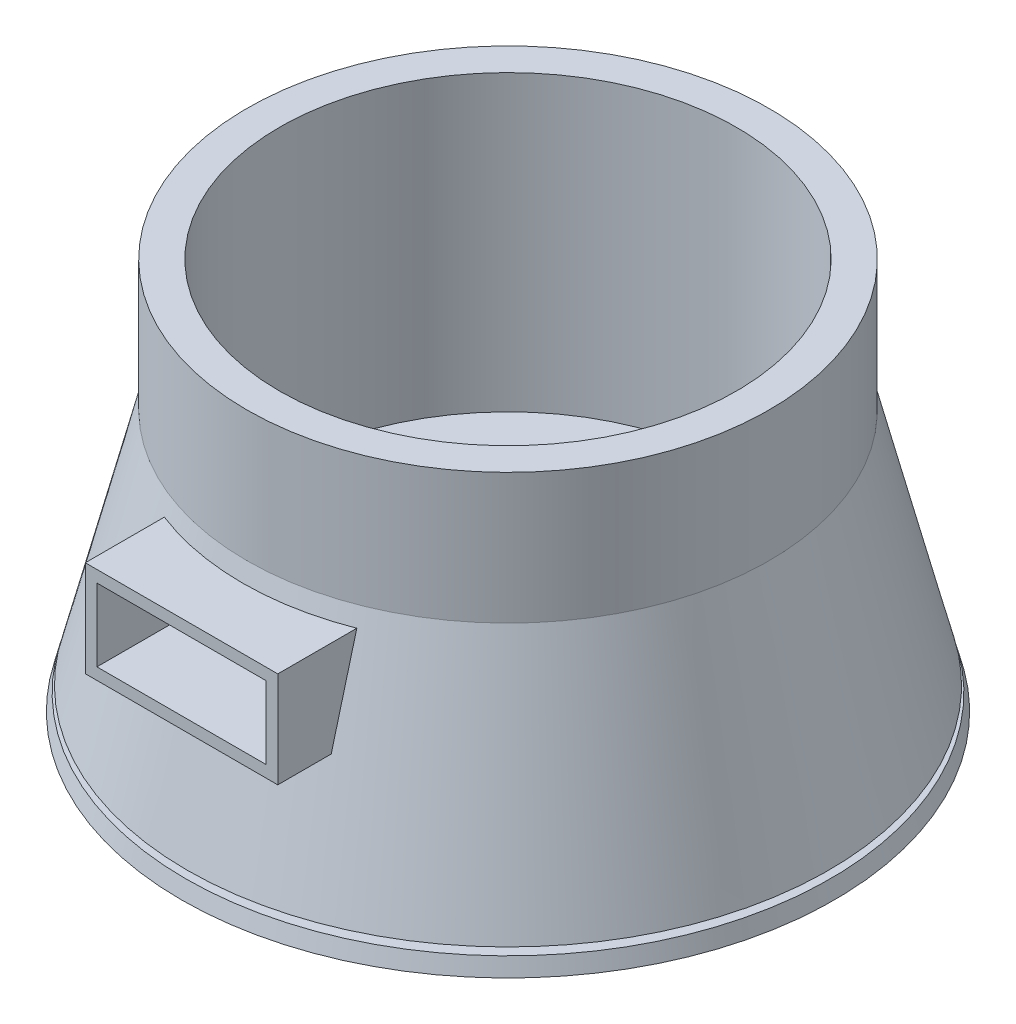
ISO-10303-21;
HEADER;
FILE_DESCRIPTION(('STEP AP214'),'2;1');
FILE_NAME('part.step','',(''),(''),'','','');
FILE_SCHEMA(('AUTOMOTIVE_DESIGN { 1 0 10303 214 1 1 1 1 }'));
ENDSEC;
DATA;
#1=APPLICATION_CONTEXT('core data for automotive mechanical design processes');
#2=APPLICATION_PROTOCOL_DEFINITION('international standard','automotive_design',2000,#1);
#3=PRODUCT_CONTEXT('',#1,'mechanical');
#4=PRODUCT('Part','Part','',(#3));
#5=PRODUCT_RELATED_PRODUCT_CATEGORY('part','',(#4));
#6=PRODUCT_DEFINITION_FORMATION('','',#4);
#7=PRODUCT_DEFINITION_CONTEXT('part definition',#1,'design');
#8=PRODUCT_DEFINITION('design','',#6,#7);
#9=PRODUCT_DEFINITION_SHAPE('','',#8);
#10=(LENGTH_UNIT() NAMED_UNIT(*) SI_UNIT(.MILLI.,.METRE.));
#11=(NAMED_UNIT(*) PLANE_ANGLE_UNIT() SI_UNIT($,.RADIAN.));
#12=(NAMED_UNIT(*) SI_UNIT($,.STERADIAN.) SOLID_ANGLE_UNIT());
#13=UNCERTAINTY_MEASURE_WITH_UNIT(LENGTH_MEASURE(1.E-05),#10,'distance_accuracy_value','');
#14=(GEOMETRIC_REPRESENTATION_CONTEXT(3) GLOBAL_UNCERTAINTY_ASSIGNED_CONTEXT((#13)) GLOBAL_UNIT_ASSIGNED_CONTEXT((#10,
#11,#12)) REPRESENTATION_CONTEXT('',''));
#15=CARTESIAN_POINT('',(0.,0.,0.));
#16=DIRECTION('',(0.,0.,1.));
#17=DIRECTION('',(1.,0.,0.));
#18=AXIS2_PLACEMENT_3D('',#15,#16,#17);
#19=CARTESIAN_POINT('',(0.,31.4615218794639,0.));
#20=DIRECTION('',(0.,1.,0.));
#21=DIRECTION('',(0.,0.,1.));
#22=AXIS2_PLACEMENT_3D('',#19,#20,#21);
#23=CYLINDRICAL_SURFACE('',#22,5.);
#24=CARTESIAN_POINT('',(0.,2.5,0.));
#25=DIRECTION('',(0.,1.,0.));
#26=DIRECTION('',(0.,0.,1.));
#27=AXIS2_PLACEMENT_3D('',#24,#25,#26);
#28=CIRCLE('',#27,5.);
#29=CARTESIAN_POINT('',(0.,2.5,5.));
#30=VERTEX_POINT('',#29);
#31=EDGE_CURVE('E253',#30,#30,#28,.T.);
#32=ORIENTED_EDGE('',*,*,#31,.F.);
#33=EDGE_LOOP('',(#32));
#34=FACE_BOUND('',#33,.T.);
#35=CARTESIAN_POINT('',(0.,7.5,0.));
#36=DIRECTION('',(0.,1.,0.));
#37=DIRECTION('',(0.,0.,1.));
#38=AXIS2_PLACEMENT_3D('',#35,#36,#37);
#39=CIRCLE('',#38,5.);
#40=CARTESIAN_POINT('',(0.,7.5,5.));
#41=VERTEX_POINT('',#40);
#42=EDGE_CURVE('E129',#41,#41,#39,.F.);
#43=ORIENTED_EDGE('',*,*,#42,.F.);
#44=EDGE_LOOP('',(#43));
#45=FACE_BOUND('',#44,.T.);
#46=ADVANCED_FACE('F40',(#34,#45),#23,.F.);
#47=CARTESIAN_POINT('',(0.,1.25,0.));
#48=DIRECTION('',(0.,-1.,0.));
#49=DIRECTION('',(0.,0.,-1.));
#50=AXIS2_PLACEMENT_3D('',#47,#48,#49);
#51=PLANE('',#50);
#52=CARTESIAN_POINT('',(0.,1.25,0.));
#53=DIRECTION('',(0.,1.,0.));
#54=DIRECTION('',(0.,0.,1.));
#55=AXIS2_PLACEMENT_3D('',#52,#53,#54);
#56=CIRCLE('',#55,23.75);
#57=CARTESIAN_POINT('',(0.,1.25,23.75));
#58=VERTEX_POINT('',#57);
#59=EDGE_CURVE('E274',#58,#58,#56,.T.);
#60=ORIENTED_EDGE('',*,*,#59,.F.);
#61=EDGE_LOOP('',(#60));
#62=FACE_BOUND('',#61,.T.);
#63=CARTESIAN_POINT('',(0.,1.25,0.));
#64=DIRECTION('',(0.,1.,0.));
#65=DIRECTION('',(0.,0.,1.));
#66=AXIS2_PLACEMENT_3D('',#63,#64,#65);
#67=CIRCLE('',#66,24.6875);
#68=CARTESIAN_POINT('',(0.,1.25,24.6875));
#69=VERTEX_POINT('',#68);
#70=EDGE_CURVE('E217',#69,#69,#67,.T.);
#71=ORIENTED_EDGE('',*,*,#70,.T.);
#72=EDGE_LOOP('',(#71));
#73=FACE_BOUND('',#72,.T.);
#74=ADVANCED_FACE('F161',(#62,#73),#51,.F.);
#75=CARTESIAN_POINT('',(0.,1.25,0.));
#76=DIRECTION('',(0.,-1.,0.));
#77=DIRECTION('',(0.,0.,-1.));
#78=AXIS2_PLACEMENT_3D('',#75,#76,#77);
#79=CONICAL_SURFACE('',#78,24.6875,0.244978663126864);
#80=CARTESIAN_POINT('',(0.,0.,0.));
#81=DIRECTION('',(0.,1.,0.));
#82=DIRECTION('',(0.,0.,1.));
#83=AXIS2_PLACEMENT_3D('',#80,#81,#82);
#84=CIRCLE('',#83,25.);
#85=CARTESIAN_POINT('',(0.,0.,25.));
#86=VERTEX_POINT('',#85);
#87=EDGE_CURVE('E212',#86,#86,#84,.T.);
#88=ORIENTED_EDGE('',*,*,#87,.T.);
#89=EDGE_LOOP('',(#88));
#90=FACE_BOUND('',#89,.T.);
#91=ORIENTED_EDGE('',*,*,#70,.F.);
#92=EDGE_LOOP('',(#91));
#93=FACE_BOUND('',#92,.T.);
#94=ADVANCED_FACE('F163',(#90,#93),#79,.T.);
#95=CARTESIAN_POINT('',(0.,31.4615218794639,0.));
#96=DIRECTION('',(0.,1.,0.));
#97=DIRECTION('',(0.,0.,1.));
#98=AXIS2_PLACEMENT_3D('',#95,#96,#97);
#99=CYLINDRICAL_SURFACE('',#98,23.75);
#100=ORIENTED_EDGE('',*,*,#59,.T.);
#101=EDGE_LOOP('',(#100));
#102=FACE_BOUND('',#101,.T.);
#103=CARTESIAN_POINT('',(0.,1.75,0.));
#104=DIRECTION('',(0.,1.,0.));
#105=DIRECTION('',(0.,0.,1.));
#106=AXIS2_PLACEMENT_3D('',#103,#104,#105);
#107=CIRCLE('',#106,23.75);
#108=CARTESIAN_POINT('',(0.,1.75,23.75));
#109=VERTEX_POINT('',#108);
#110=EDGE_CURVE('E222',#109,#109,#107,.T.);
#111=ORIENTED_EDGE('',*,*,#110,.F.);
#112=EDGE_LOOP('',(#111));
#113=FACE_BOUND('',#112,.T.);
#114=ADVANCED_FACE('F190',(#102,#113),#99,.T.);
#115=CARTESIAN_POINT('',(0.,31.4615218794639,0.));
#116=DIRECTION('',(0.,1.,0.));
#117=DIRECTION('',(0.,0.,1.));
#118=AXIS2_PLACEMENT_3D('',#115,#116,#117);
#119=CYLINDRICAL_SURFACE('',#118,20.);
#120=CARTESIAN_POINT('',(0.,20.,0.));
#121=DIRECTION('',(0.,1.,0.));
#122=DIRECTION('',(0.,0.,1.));
#123=AXIS2_PLACEMENT_3D('',#120,#121,#122);
#124=CIRCLE('',#123,20.);
#125=CARTESIAN_POINT('',(0.,20.,20.));
#126=VERTEX_POINT('',#125);
#127=EDGE_CURVE('E207',#126,#126,#124,.T.);
#128=ORIENTED_EDGE('',*,*,#127,.T.);
#129=EDGE_LOOP('',(#128));
#130=FACE_BOUND('',#129,.T.);
#131=CARTESIAN_POINT('',(0.,30.,0.));
#132=DIRECTION('',(0.,1.,0.));
#133=DIRECTION('',(0.,0.,1.));
#134=AXIS2_PLACEMENT_3D('',#131,#132,#133);
#135=CIRCLE('',#134,20.);
#136=CARTESIAN_POINT('',(0.,30.,20.));
#137=VERTEX_POINT('',#136);
#138=EDGE_CURVE('E210',#137,#137,#135,.T.);
#139=ORIENTED_EDGE('',*,*,#138,.F.);
#140=EDGE_LOOP('',(#139));
#141=FACE_BOUND('',#140,.T.);
#142=ADVANCED_FACE('F193',(#130,#141),#119,.T.);
#143=CARTESIAN_POINT('',(0.,20.,0.));
#144=DIRECTION('',(0.,-1.,0.));
#145=DIRECTION('',(0.,0.,-1.));
#146=AXIS2_PLACEMENT_3D('',#143,#144,#145);
#147=CONICAL_SURFACE('',#146,20.,0.244978663126864);
#148=CARTESIAN_POINT('',(7.37000000000001,-14.3216899381842,27.6138307627744));
#149=CARTESIAN_POINT('',(7.37000000000001,-12.4658660344797,27.133621653967));
#150=CARTESIAN_POINT('',(7.37000000000001,-10.6102378051404,26.6526549550244));
#151=CARTESIAN_POINT('',(7.37000000000001,-6.89945704703358,25.6888831354113));
#152=CARTESIAN_POINT('',(7.37000000000001,-5.04430451870854,25.2060780130375));
#153=CARTESIAN_POINT('',(7.37000000000001,-1.33451409837843,24.2382942487228));
#154=CARTESIAN_POINT('',(7.37,0.520123778784556,23.7533155498681));
#155=CARTESIAN_POINT('',(7.37,4.22871941399425,22.780766472461));
#156=CARTESIAN_POINT('',(7.37,6.08267717228313,22.2931960948324));
#157=CARTESIAN_POINT('',(7.37,9.78952780102709,21.3149763770174));
#158=CARTESIAN_POINT('',(7.37,11.6424207771001,20.8243274372334));
#159=CARTESIAN_POINT('',(7.37,15.3471795180583,19.8391672524519));
#160=CARTESIAN_POINT('',(7.37,17.1990452833739,19.3446560090739));
#161=CARTESIAN_POINT('',(7.37,20.9014636237397,18.350804274735));
#162=CARTESIAN_POINT('',(7.37,22.7520162103477,17.8514638268587));
#163=CARTESIAN_POINT('',(7.37,26.4514465925507,16.8466215226613));
#164=CARTESIAN_POINT('',(7.37,28.3003243914189,16.34111967841));
#165=CARTESIAN_POINT('',(7.37,31.3316931131378,15.5051771662246));
#166=CARTESIAN_POINT('',(7.37,32.5148415559899,15.1771215767288));
#167=CARTESIAN_POINT('',(7.37,34.8800134671355,14.5169886077337));
#168=CARTESIAN_POINT('',(7.37,36.0620369383523,14.184911238716));
#169=CARTESIAN_POINT('',(7.37,38.4247369168027,13.5158201791193));
#170=CARTESIAN_POINT('',(7.37,39.6054133710248,13.1788063010293));
#171=CARTESIAN_POINT('',(7.37,41.3751033208345,12.6686682671595));
#172=CARTESIAN_POINT('',(7.36999999999999,41.9647821776197,12.4978518393217));
#173=CARTESIAN_POINT('',(7.36999999999999,43.1436328361598,12.1544739899294));
#174=CARTESIAN_POINT('',(7.36999999999999,43.7328046368487,11.9819125647162));
#175=CARTESIAN_POINT('',(7.36999999999999,44.3216899381842,11.8083757650547));
#176=B_SPLINE_CURVE_WITH_KNOTS('',3,(#148,#149,#150,#151,#152,#153,#154,#155,#156,#157,#158,
#159,#160,#161,#162,#163,#164,#165,#166,#167,#168,#169,#170,#171,#172,#173,#174,#175),
.UNSPECIFIED.,.F.,.F.,(4,2,2,2,2,2,2,2,2,2,2,2,2,4),(0.,5.75083928311323,11.5016838949989,
17.2526799790413,23.0036740133579,28.7539349599857,34.5041934955168,40.254400776337,
46.0045967948004,49.6879518684337,53.3712973444617,57.0547830952882,58.8965447033079,
60.7383101738493),.UNSPECIFIED.);
#177=CARTESIAN_POINT('',(7.37,11.32,20.909136758843));
#178=VERTEX_POINT('',#177);
#179=CARTESIAN_POINT('',(7.37,18.68,18.9470842083947));
#180=VERTEX_POINT('',#179);
#181=EDGE_CURVE('E122',#178,#180,#176,.T.);
#182=ORIENTED_EDGE('',*,*,#181,.F.);
#183=CARTESIAN_POINT('',(0.,11.32,0.));
#184=DIRECTION('',(0.,1.,0.));
#185=DIRECTION('',(-1.,0.,0.));
#186=AXIS2_PLACEMENT_3D('',#183,#184,#185);
#187=CIRCLE('',#186,22.17);
#188=CARTESIAN_POINT('',(-7.37,11.32,20.909136758843));
#189=VERTEX_POINT('',#188);
#190=EDGE_CURVE('E232',#178,#189,#187,.F.);
#191=ORIENTED_EDGE('',*,*,#190,.T.);
#192=CARTESIAN_POINT('',(-7.36999999999999,-14.3216899381842,27.6138307627744));
#193=CARTESIAN_POINT('',(-7.36999999999999,-12.4658660344798,27.133621653967));
#194=CARTESIAN_POINT('',(-7.36999999999999,-10.6102378051404,26.6526549550244));
#195=CARTESIAN_POINT('',(-7.36999999999999,-6.89945704703359,25.6888831354113));
#196=CARTESIAN_POINT('',(-7.36999999999999,-5.04430451870854,25.2060780130375));
#197=CARTESIAN_POINT('',(-7.36999999999999,-1.33451409837844,24.2382942487228));
#198=CARTESIAN_POINT('',(-7.37,0.520123778784551,23.7533155498681));
#199=CARTESIAN_POINT('',(-7.37,4.22871941399425,22.780766472461));
#200=CARTESIAN_POINT('',(-7.37,6.08267717228312,22.2931960948324));
#201=CARTESIAN_POINT('',(-7.37,9.78952780102709,21.3149763770174));
#202=CARTESIAN_POINT('',(-7.37,11.6424207771001,20.8243274372334));
#203=CARTESIAN_POINT('',(-7.37,15.3471795180583,19.8391672524519));
#204=CARTESIAN_POINT('',(-7.37,17.1990452833739,19.3446560090739));
#205=CARTESIAN_POINT('',(-7.37,20.9014636237397,18.350804274735));
#206=CARTESIAN_POINT('',(-7.37,22.7520162103477,17.8514638268587));
#207=CARTESIAN_POINT('',(-7.37,26.4514465925507,16.8466215226613));
#208=CARTESIAN_POINT('',(-7.37,28.3003243914189,16.34111967841));
#209=CARTESIAN_POINT('',(-7.37,31.3316931131378,15.5051771662246));
#210=CARTESIAN_POINT('',(-7.37,32.5148415559899,15.1771215767288));
#211=CARTESIAN_POINT('',(-7.37,34.8800134671355,14.5169886077337));
#212=CARTESIAN_POINT('',(-7.37,36.0620369383523,14.184911238716));
#213=CARTESIAN_POINT('',(-7.37,38.4247369168027,13.5158201791192));
#214=CARTESIAN_POINT('',(-7.37,39.6054133710248,13.1788063010293));
#215=CARTESIAN_POINT('',(-7.37,41.3751033208345,12.6686682671595));
#216=CARTESIAN_POINT('',(-7.37000000000001,41.9647821776197,12.4978518393217));
#217=CARTESIAN_POINT('',(-7.37000000000001,43.1436328361598,12.1544739899294));
#218=CARTESIAN_POINT('',(-7.37000000000001,43.7328046368487,11.9819125647162));
#219=CARTESIAN_POINT('',(-7.37000000000001,44.3216899381842,11.8083757650547));
#220=B_SPLINE_CURVE_WITH_KNOTS('',3,(#192,#193,#194,#195,#196,#197,#198,#199,#200,#201,#202,
#203,#204,#205,#206,#207,#208,#209,#210,#211,#212,#213,#214,#215,#216,#217,#218,#219),
.UNSPECIFIED.,.F.,.F.,(4,2,2,2,2,2,2,2,2,2,2,2,2,4),(0.,5.75083928311323,11.5016838949989,
17.2526799790413,23.0036740133579,28.7539349599858,34.5041934955168,40.254400776337,
46.0045967948004,49.6879518684337,53.3712973444617,57.0547830952882,58.8965447033079,
60.7383101738493),.UNSPECIFIED.);
#221=CARTESIAN_POINT('',(-7.37,18.68,18.9470842083947));
#222=VERTEX_POINT('',#221);
#223=EDGE_CURVE('E141',#189,#222,#220,.T.);
#224=ORIENTED_EDGE('',*,*,#223,.T.);
#225=CARTESIAN_POINT('',(0.,18.68,0.));
#226=DIRECTION('',(0.,1.,0.));
#227=DIRECTION('',(0.,0.,1.));
#228=AXIS2_PLACEMENT_3D('',#225,#226,#227);
#229=CIRCLE('',#228,20.33);
#230=EDGE_CURVE('E231',#180,#222,#229,.F.);
#231=ORIENTED_EDGE('',*,*,#230,.F.);
#232=EDGE_LOOP('',(#182,#191,#224,#231));
#233=FACE_BOUND('',#232,.T.);
#234=CARTESIAN_POINT('',(0.,1.75,0.));
#235=DIRECTION('',(0.,1.,0.));
#236=DIRECTION('',(0.,0.,1.));
#237=AXIS2_PLACEMENT_3D('',#234,#235,#236);
#238=CIRCLE('',#237,24.5625);
#239=CARTESIAN_POINT('',(0.,1.75,24.5625));
#240=VERTEX_POINT('',#239);
#241=EDGE_CURVE('E214',#240,#240,#238,.T.);
#242=ORIENTED_EDGE('',*,*,#241,.T.);
#243=EDGE_LOOP('',(#242));
#244=FACE_BOUND('',#243,.T.);
#245=ORIENTED_EDGE('',*,*,#127,.F.);
#246=EDGE_LOOP('',(#245));
#247=FACE_BOUND('',#246,.T.);
#248=ADVANCED_FACE('F148',(#233,#244,#247),#147,.T.);
#249=CARTESIAN_POINT('',(0.,1.75,0.));
#250=DIRECTION('',(0.,-1.,0.));
#251=DIRECTION('',(0.,0.,-1.));
#252=AXIS2_PLACEMENT_3D('',#249,#250,#251);
#253=PLANE('',#252);
#254=ORIENTED_EDGE('',*,*,#110,.T.);
#255=EDGE_LOOP('',(#254));
#256=FACE_BOUND('',#255,.T.);
#257=ORIENTED_EDGE('',*,*,#241,.F.);
#258=EDGE_LOOP('',(#257));
#259=FACE_BOUND('',#258,.T.);
#260=ADVANCED_FACE('F200',(#256,#259),#253,.T.);
#261=CARTESIAN_POINT('',(0.,0.,0.));
#262=DIRECTION('',(0.,1.,0.));
#263=DIRECTION('',(0.,0.,1.));
#264=AXIS2_PLACEMENT_3D('',#261,#262,#263);
#265=PLANE('',#264);
#266=CARTESIAN_POINT('',(0.,0.,0.));
#267=DIRECTION('',(0.,1.,0.));
#268=DIRECTION('',(0.,0.,1.));
#269=AXIS2_PLACEMENT_3D('',#266,#267,#268);
#270=CIRCLE('',#269,24.);
#271=CARTESIAN_POINT('',(0.,0.,24.));
#272=VERTEX_POINT('',#271);
#273=EDGE_CURVE('E268',#272,#272,#270,.T.);
#274=ORIENTED_EDGE('',*,*,#273,.T.);
#275=EDGE_LOOP('',(#274));
#276=FACE_BOUND('',#275,.T.);
#277=ORIENTED_EDGE('',*,*,#87,.F.);
#278=EDGE_LOOP('',(#277));
#279=FACE_BOUND('',#278,.T.);
#280=ADVANCED_FACE('F177',(#276,#279),#265,.F.);
#281=CARTESIAN_POINT('',(0.,31.4615218794639,0.));
#282=DIRECTION('',(0.,1.,0.));
#283=DIRECTION('',(0.,0.,1.));
#284=AXIS2_PLACEMENT_3D('',#281,#282,#283);
#285=CYLINDRICAL_SURFACE('',#284,23.5);
#286=CARTESIAN_POINT('',(0.,0.,0.));
#287=DIRECTION('',(0.,1.,0.));
#288=DIRECTION('',(0.,0.,1.));
#289=AXIS2_PLACEMENT_3D('',#286,#287,#288);
#290=CIRCLE('',#289,23.5);
#291=CARTESIAN_POINT('',(0.,0.,23.5));
#292=VERTEX_POINT('',#291);
#293=EDGE_CURVE('E271',#292,#292,#290,.T.);
#294=ORIENTED_EDGE('',*,*,#293,.T.);
#295=EDGE_LOOP('',(#294));
#296=FACE_BOUND('',#295,.T.);
#297=CARTESIAN_POINT('',(0.,0.750000000000001,0.));
#298=DIRECTION('',(0.,1.,0.));
#299=DIRECTION('',(0.,0.,1.));
#300=AXIS2_PLACEMENT_3D('',#297,#298,#299);
#301=CIRCLE('',#300,23.5);
#302=CARTESIAN_POINT('',(0.,0.750000000000001,23.5));
#303=VERTEX_POINT('',#302);
#304=EDGE_CURVE('E262',#303,#303,#301,.T.);
#305=ORIENTED_EDGE('',*,*,#304,.F.);
#306=EDGE_LOOP('',(#305));
#307=FACE_BOUND('',#306,.T.);
#308=ADVANCED_FACE('F173',(#296,#307),#285,.T.);
#309=CARTESIAN_POINT('',(0.,0.749999999999999,0.));
#310=DIRECTION('',(0.,-1.,0.));
#311=DIRECTION('',(0.,0.,-1.));
#312=AXIS2_PLACEMENT_3D('',#309,#310,#311);
#313=PLANE('',#312);
#314=ORIENTED_EDGE('',*,*,#304,.T.);
#315=EDGE_LOOP('',(#314));
#316=FACE_BOUND('',#315,.T.);
#317=CARTESIAN_POINT('',(0.,0.750000000000001,0.));
#318=DIRECTION('',(0.,1.,0.));
#319=DIRECTION('',(0.,0.,1.));
#320=AXIS2_PLACEMENT_3D('',#317,#318,#319);
#321=CIRCLE('',#320,24.);
#322=CARTESIAN_POINT('',(0.,0.750000000000001,24.));
#323=VERTEX_POINT('',#322);
#324=EDGE_CURVE('E265',#323,#323,#321,.T.);
#325=ORIENTED_EDGE('',*,*,#324,.F.);
#326=EDGE_LOOP('',(#325));
#327=FACE_BOUND('',#326,.T.);
#328=ADVANCED_FACE('F176',(#316,#327),#313,.T.);
#329=CARTESIAN_POINT('',(0.,31.4615218794639,0.));
#330=DIRECTION('',(0.,1.,0.));
#331=DIRECTION('',(0.,0.,1.));
#332=AXIS2_PLACEMENT_3D('',#329,#330,#331);
#333=CYLINDRICAL_SURFACE('',#332,24.);
#334=ORIENTED_EDGE('',*,*,#273,.F.);
#335=EDGE_LOOP('',(#334));
#336=FACE_BOUND('',#335,.T.);
#337=ORIENTED_EDGE('',*,*,#324,.T.);
#338=EDGE_LOOP('',(#337));
#339=FACE_BOUND('',#338,.T.);
#340=ADVANCED_FACE('F181',(#336,#339),#333,.F.);
#341=CARTESIAN_POINT('',(0.,30.,0.));
#342=DIRECTION('',(0.,1.,0.));
#343=DIRECTION('',(0.,0.,1.));
#344=AXIS2_PLACEMENT_3D('',#341,#342,#343);
#345=PLANE('',#344);
#346=CARTESIAN_POINT('',(0.,30.,0.));
#347=DIRECTION('',(0.,1.,0.));
#348=DIRECTION('',(0.,0.,1.));
#349=AXIS2_PLACEMENT_3D('',#346,#347,#348);
#350=CIRCLE('',#349,17.5);
#351=CARTESIAN_POINT('',(0.,30.,17.5));
#352=VERTEX_POINT('',#351);
#353=EDGE_CURVE('E542',#352,#352,#350,.T.);
#354=ORIENTED_EDGE('',*,*,#353,.F.);
#355=EDGE_LOOP('',(#354));
#356=FACE_BOUND('',#355,.T.);
#357=ORIENTED_EDGE('',*,*,#138,.T.);
#358=EDGE_LOOP('',(#357));
#359=FACE_BOUND('',#358,.T.);
#360=ADVANCED_FACE('F185',(#356,#359),#345,.T.);
#361=CARTESIAN_POINT('',(0.,0.,0.));
#362=DIRECTION('',(0.,1.,0.));
#363=DIRECTION('',(0.,0.,1.));
#364=AXIS2_PLACEMENT_3D('',#361,#362,#363);
#365=CIRCLE('',#364,22.5);
#366=CARTESIAN_POINT('',(0.,0.,22.5));
#367=VERTEX_POINT('',#366);
#368=EDGE_CURVE('E259',#367,#367,#365,.T.);
#369=ORIENTED_EDGE('',*,*,#368,.T.);
#370=EDGE_LOOP('',(#369));
#371=FACE_BOUND('',#370,.T.);
#372=ORIENTED_EDGE('',*,*,#293,.F.);
#373=EDGE_LOOP('',(#372));
#374=FACE_BOUND('',#373,.T.);
#375=ADVANCED_FACE('F42',(#371,#374),#265,.F.);
#376=CARTESIAN_POINT('',(0.,0.,0.));
#377=DIRECTION('',(0.,-1.,0.));
#378=DIRECTION('',(0.,0.,-1.));
#379=AXIS2_PLACEMENT_3D('',#376,#377,#378);
#380=CONICAL_SURFACE('',#379,22.5,1.24904577239825);
#381=CARTESIAN_POINT('',(0.,2.5,0.));
#382=DIRECTION('',(0.,1.,0.));
#383=DIRECTION('',(0.,0.,1.));
#384=AXIS2_PLACEMENT_3D('',#381,#382,#383);
#385=CIRCLE('',#384,15.);
#386=CARTESIAN_POINT('',(0.,2.5,15.));
#387=VERTEX_POINT('',#386);
#388=EDGE_CURVE('E256',#387,#387,#385,.T.);
#389=ORIENTED_EDGE('',*,*,#388,.T.);
#390=EDGE_LOOP('',(#389));
#391=FACE_BOUND('',#390,.T.);
#392=ORIENTED_EDGE('',*,*,#368,.F.);
#393=EDGE_LOOP('',(#392));
#394=FACE_BOUND('',#393,.T.);
#395=ADVANCED_FACE('F168',(#391,#394),#380,.F.);
#396=CARTESIAN_POINT('',(0.,2.5,0.));
#397=DIRECTION('',(0.,-1.,0.));
#398=DIRECTION('',(0.,0.,-1.));
#399=AXIS2_PLACEMENT_3D('',#396,#397,#398);
#400=PLANE('',#399);
#401=ORIENTED_EDGE('',*,*,#31,.T.);
#402=EDGE_LOOP('',(#401));
#403=FACE_BOUND('',#402,.T.);
#404=ORIENTED_EDGE('',*,*,#388,.F.);
#405=EDGE_LOOP('',(#404));
#406=FACE_BOUND('',#405,.T.);
#407=ADVANCED_FACE('F164',(#403,#406),#400,.T.);
#408=CARTESIAN_POINT('',(0.,17.78,25.));
#409=DIRECTION('',(0.,1.,0.));
#410=DIRECTION('',(0.,0.,1.));
#411=AXIS2_PLACEMENT_3D('',#408,#409,#410);
#412=PLANE('',#411);
#413=DIRECTION('',(0.,0.,-1.));
#414=VECTOR('',#413,1.);
#415=CARTESIAN_POINT('',(-6.48,17.78,25.));
#416=LINE('',#415,#414);
#417=CARTESIAN_POINT('',(-6.48,17.78,25.));
#418=VERTEX_POINT('',#417);
#419=CARTESIAN_POINT('',(-6.48,17.78,16.256063484128));
#420=VERTEX_POINT('',#419);
#421=EDGE_CURVE('E116',#418,#420,#416,.T.);
#422=ORIENTED_EDGE('',*,*,#421,.T.);
#423=CARTESIAN_POINT('',(0.,17.78,0.));
#424=DIRECTION('',(0.,1.,0.));
#425=DIRECTION('',(0.,0.,1.));
#426=AXIS2_PLACEMENT_3D('',#423,#424,#425);
#427=CIRCLE('',#426,17.5);
#428=CARTESIAN_POINT('',(6.48,17.78,16.256063484128));
#429=VERTEX_POINT('',#428);
#430=EDGE_CURVE('E48',#429,#420,#427,.F.);
#431=ORIENTED_EDGE('',*,*,#430,.F.);
#432=DIRECTION('',(0.,0.,-1.));
#433=VECTOR('',#432,1.);
#434=CARTESIAN_POINT('',(6.48,17.78,25.));
#435=LINE('',#434,#433);
#436=CARTESIAN_POINT('',(6.48,17.78,25.));
#437=VERTEX_POINT('',#436);
#438=EDGE_CURVE('E251',#437,#429,#435,.T.);
#439=ORIENTED_EDGE('',*,*,#438,.F.);
#440=DIRECTION('',(1.,0.,0.));
#441=VECTOR('',#440,1.);
#442=CARTESIAN_POINT('',(0.,17.78,25.));
#443=LINE('',#442,#441);
#444=EDGE_CURVE('E524',#418,#437,#443,.T.);
#445=ORIENTED_EDGE('',*,*,#444,.F.);
#446=EDGE_LOOP('',(#422,#431,#439,#445));
#447=FACE_BOUND('',#446,.T.);
#448=ADVANCED_FACE('F167',(#447),#412,.F.);
#449=CARTESIAN_POINT('',(6.48,0.,25.));
#450=DIRECTION('',(1.,0.,0.));
#451=DIRECTION('',(0.,0.,-1.));
#452=AXIS2_PLACEMENT_3D('',#449,#450,#451);
#453=PLANE('',#452);
#454=ORIENTED_EDGE('',*,*,#438,.T.);
#455=DIRECTION('',(0.,1.,0.));
#456=VECTOR('',#455,1.);
#457=CARTESIAN_POINT('',(6.48,7.5,16.256063484128));
#458=LINE('',#457,#456);
#459=CARTESIAN_POINT('',(6.48,12.22,16.256063484128));
#460=VERTEX_POINT('',#459);
#461=EDGE_CURVE('E11',#460,#429,#458,.T.);
#462=ORIENTED_EDGE('',*,*,#461,.F.);
#463=DIRECTION('',(0.,0.,-1.));
#464=VECTOR('',#463,1.);
#465=CARTESIAN_POINT('',(6.48,12.22,25.));
#466=LINE('',#465,#464);
#467=CARTESIAN_POINT('',(6.48,12.22,25.));
#468=VERTEX_POINT('',#467);
#469=EDGE_CURVE('E55',#468,#460,#466,.T.);
#470=ORIENTED_EDGE('',*,*,#469,.F.);
#471=DIRECTION('',(0.,-1.,0.));
#472=VECTOR('',#471,1.);
#473=CARTESIAN_POINT('',(6.48,0.,25.));
#474=LINE('',#473,#472);
#475=EDGE_CURVE('E520',#437,#468,#474,.T.);
#476=ORIENTED_EDGE('',*,*,#475,.F.);
#477=EDGE_LOOP('',(#454,#462,#470,#476));
#478=FACE_BOUND('',#477,.T.);
#479=ADVANCED_FACE('F465',(#478),#453,.F.);
#480=CARTESIAN_POINT('',(0.,12.22,25.));
#481=DIRECTION('',(0.,1.,0.));
#482=DIRECTION('',(0.,0.,1.));
#483=AXIS2_PLACEMENT_3D('',#480,#481,#482);
#484=PLANE('',#483);
#485=ORIENTED_EDGE('',*,*,#469,.T.);
#486=CARTESIAN_POINT('',(0.,12.22,0.));
#487=DIRECTION('',(0.,1.,0.));
#488=DIRECTION('',(0.,0.,1.));
#489=AXIS2_PLACEMENT_3D('',#486,#487,#488);
#490=CIRCLE('',#489,17.5);
#491=CARTESIAN_POINT('',(-6.48,12.22,16.256063484128));
#492=VERTEX_POINT('',#491);
#493=EDGE_CURVE('E119',#460,#492,#490,.F.);
#494=ORIENTED_EDGE('',*,*,#493,.T.);
#495=DIRECTION('',(0.,0.,-1.));
#496=VECTOR('',#495,1.);
#497=CARTESIAN_POINT('',(-6.48,12.22,25.));
#498=LINE('',#497,#496);
#499=CARTESIAN_POINT('',(-6.48,12.22,25.));
#500=VERTEX_POINT('',#499);
#501=EDGE_CURVE('E108',#500,#492,#498,.T.);
#502=ORIENTED_EDGE('',*,*,#501,.F.);
#503=DIRECTION('',(1.,0.,0.));
#504=VECTOR('',#503,1.);
#505=CARTESIAN_POINT('',(0.,12.22,25.));
#506=LINE('',#505,#504);
#507=EDGE_CURVE('E532',#500,#468,#506,.T.);
#508=ORIENTED_EDGE('',*,*,#507,.T.);
#509=EDGE_LOOP('',(#485,#494,#502,#508));
#510=FACE_BOUND('',#509,.T.);
#511=ADVANCED_FACE('F120',(#510),#484,.T.);
#512=CARTESIAN_POINT('',(7.37000000000001,0.,25.));
#513=DIRECTION('',(1.,0.,0.));
#514=DIRECTION('',(0.,1.,0.));
#515=AXIS2_PLACEMENT_3D('',#512,#513,#514);
#516=PLANE('',#515);
#517=DIRECTION('',(0.,0.,-1.));
#518=VECTOR('',#517,1.);
#519=CARTESIAN_POINT('',(7.37,11.32,25.));
#520=LINE('',#519,#518);
#521=CARTESIAN_POINT('',(7.37,11.32,25.));
#522=VERTEX_POINT('',#521);
#523=EDGE_CURVE('E246',#522,#178,#520,.T.);
#524=ORIENTED_EDGE('',*,*,#523,.T.);
#525=ORIENTED_EDGE('',*,*,#181,.T.);
#526=DIRECTION('',(0.,0.,-1.));
#527=VECTOR('',#526,1.);
#528=CARTESIAN_POINT('',(7.37,18.68,25.));
#529=LINE('',#528,#527);
#530=CARTESIAN_POINT('',(7.37,18.68,25.));
#531=VERTEX_POINT('',#530);
#532=EDGE_CURVE('E242',#531,#180,#529,.T.);
#533=ORIENTED_EDGE('',*,*,#532,.F.);
#534=DIRECTION('',(0.,-1.,0.));
#535=VECTOR('',#534,1.);
#536=CARTESIAN_POINT('',(7.37000000000001,0.,25.));
#537=LINE('',#536,#535);
#538=EDGE_CURVE('E132',#531,#522,#537,.T.);
#539=ORIENTED_EDGE('',*,*,#538,.T.);
#540=EDGE_LOOP('',(#524,#525,#533,#539));
#541=FACE_BOUND('',#540,.T.);
#542=ADVANCED_FACE('F152',(#541),#516,.T.);
#543=CARTESIAN_POINT('',(0.,18.68,25.));
#544=DIRECTION('',(0.,1.,0.));
#545=DIRECTION('',(0.,0.,1.));
#546=AXIS2_PLACEMENT_3D('',#543,#544,#545);
#547=PLANE('',#546);
#548=ORIENTED_EDGE('',*,*,#532,.T.);
#549=ORIENTED_EDGE('',*,*,#230,.T.);
#550=DIRECTION('',(0.,0.,-1.));
#551=VECTOR('',#550,1.);
#552=CARTESIAN_POINT('',(-7.37,18.68,25.));
#553=LINE('',#552,#551);
#554=CARTESIAN_POINT('',(-7.37,18.68,25.));
#555=VERTEX_POINT('',#554);
#556=EDGE_CURVE('E237',#555,#222,#553,.T.);
#557=ORIENTED_EDGE('',*,*,#556,.F.);
#558=DIRECTION('',(1.,0.,0.));
#559=VECTOR('',#558,1.);
#560=CARTESIAN_POINT('',(0.,18.68,25.));
#561=LINE('',#560,#559);
#562=EDGE_CURVE('E539',#555,#531,#561,.T.);
#563=ORIENTED_EDGE('',*,*,#562,.T.);
#564=EDGE_LOOP('',(#548,#549,#557,#563));
#565=FACE_BOUND('',#564,.T.);
#566=ADVANCED_FACE('F157',(#565),#547,.T.);
#567=CARTESIAN_POINT('',(-7.36999999999999,0.,25.));
#568=DIRECTION('',(1.,0.,0.));
#569=DIRECTION('',(0.,1.,0.));
#570=AXIS2_PLACEMENT_3D('',#567,#568,#569);
#571=PLANE('',#570);
#572=ORIENTED_EDGE('',*,*,#223,.F.);
#573=DIRECTION('',(0.,0.,-1.));
#574=VECTOR('',#573,1.);
#575=CARTESIAN_POINT('',(-7.37,11.32,25.));
#576=LINE('',#575,#574);
#577=CARTESIAN_POINT('',(-7.37,11.32,25.));
#578=VERTEX_POINT('',#577);
#579=EDGE_CURVE('E63',#578,#189,#576,.T.);
#580=ORIENTED_EDGE('',*,*,#579,.F.);
#581=DIRECTION('',(0.,-1.,0.));
#582=VECTOR('',#581,1.);
#583=CARTESIAN_POINT('',(-7.36999999999999,0.,25.));
#584=LINE('',#583,#582);
#585=EDGE_CURVE('E238',#555,#578,#584,.T.);
#586=ORIENTED_EDGE('',*,*,#585,.F.);
#587=ORIENTED_EDGE('',*,*,#556,.T.);
#588=EDGE_LOOP('',(#572,#580,#586,#587));
#589=FACE_BOUND('',#588,.T.);
#590=ADVANCED_FACE('F235',(#589),#571,.F.);
#591=CARTESIAN_POINT('',(0.,11.32,25.));
#592=DIRECTION('',(0.,1.,0.));
#593=DIRECTION('',(-1.,0.,0.));
#594=AXIS2_PLACEMENT_3D('',#591,#592,#593);
#595=PLANE('',#594);
#596=ORIENTED_EDGE('',*,*,#190,.F.);
#597=ORIENTED_EDGE('',*,*,#523,.F.);
#598=DIRECTION('',(1.,0.,0.));
#599=VECTOR('',#598,1.);
#600=CARTESIAN_POINT('',(0.,11.32,25.));
#601=LINE('',#600,#599);
#602=EDGE_CURVE('E536',#578,#522,#601,.T.);
#603=ORIENTED_EDGE('',*,*,#602,.F.);
#604=ORIENTED_EDGE('',*,*,#579,.T.);
#605=EDGE_LOOP('',(#596,#597,#603,#604));
#606=FACE_BOUND('',#605,.T.);
#607=ADVANCED_FACE('F417',(#606),#595,.F.);
#608=CARTESIAN_POINT('',(-6.48,0.,25.));
#609=DIRECTION('',(1.,0.,0.));
#610=DIRECTION('',(0.,0.,-1.));
#611=AXIS2_PLACEMENT_3D('',#608,#609,#610);
#612=PLANE('',#611);
#613=ORIENTED_EDGE('',*,*,#501,.T.);
#614=DIRECTION('',(0.,1.,0.));
#615=VECTOR('',#614,1.);
#616=CARTESIAN_POINT('',(-6.48,7.5,16.256063484128));
#617=LINE('',#616,#615);
#618=EDGE_CURVE('E111',#492,#420,#617,.T.);
#619=ORIENTED_EDGE('',*,*,#618,.T.);
#620=ORIENTED_EDGE('',*,*,#421,.F.);
#621=DIRECTION('',(0.,-1.,0.));
#622=VECTOR('',#621,1.);
#623=CARTESIAN_POINT('',(-6.48,0.,25.));
#624=LINE('',#623,#622);
#625=EDGE_CURVE('E114',#418,#500,#624,.T.);
#626=ORIENTED_EDGE('',*,*,#625,.T.);
#627=EDGE_LOOP('',(#613,#619,#620,#626));
#628=FACE_BOUND('',#627,.T.);
#629=ADVANCED_FACE('F109',(#628),#612,.T.);
#630=CARTESIAN_POINT('',(0.,0.,25.));
#631=DIRECTION('',(0.,0.,1.));
#632=DIRECTION('',(1.,0.,0.));
#633=AXIS2_PLACEMENT_3D('',#630,#631,#632);
#634=PLANE('',#633);
#635=ORIENTED_EDGE('',*,*,#538,.F.);
#636=ORIENTED_EDGE('',*,*,#562,.F.);
#637=ORIENTED_EDGE('',*,*,#585,.T.);
#638=ORIENTED_EDGE('',*,*,#602,.T.);
#639=EDGE_LOOP('',(#635,#636,#637,#638));
#640=FACE_BOUND('',#639,.T.);
#641=ORIENTED_EDGE('',*,*,#444,.T.);
#642=ORIENTED_EDGE('',*,*,#475,.T.);
#643=ORIENTED_EDGE('',*,*,#507,.F.);
#644=ORIENTED_EDGE('',*,*,#625,.F.);
#645=EDGE_LOOP('',(#641,#642,#643,#644));
#646=FACE_BOUND('',#645,.T.);
#647=ADVANCED_FACE('F430',(#640,#646),#634,.T.);
#648=CARTESIAN_POINT('',(0.,7.5,0.));
#649=DIRECTION('',(0.,1.,0.));
#650=DIRECTION('',(0.,0.,1.));
#651=AXIS2_PLACEMENT_3D('',#648,#649,#650);
#652=PLANE('',#651);
#653=CARTESIAN_POINT('',(0.,7.5,0.));
#654=DIRECTION('',(0.,1.,0.));
#655=DIRECTION('',(0.,0.,1.));
#656=AXIS2_PLACEMENT_3D('',#653,#654,#655);
#657=CIRCLE('',#656,17.5);
#658=CARTESIAN_POINT('',(0.,7.5,17.5));
#659=VERTEX_POINT('',#658);
#660=EDGE_CURVE('E133',#659,#659,#657,.T.);
#661=ORIENTED_EDGE('',*,*,#660,.T.);
#662=EDGE_LOOP('',(#661));
#663=FACE_BOUND('',#662,.T.);
#664=ORIENTED_EDGE('',*,*,#42,.T.);
#665=EDGE_LOOP('',(#664));
#666=FACE_BOUND('',#665,.T.);
#667=ADVANCED_FACE('F438',(#663,#666),#652,.T.);
#668=CARTESIAN_POINT('',(0.,7.5,0.));
#669=DIRECTION('',(0.,1.,0.));
#670=DIRECTION('',(0.,0.,1.));
#671=AXIS2_PLACEMENT_3D('',#668,#669,#670);
#672=CYLINDRICAL_SURFACE('',#671,17.5);
#673=ORIENTED_EDGE('',*,*,#493,.F.);
#674=ORIENTED_EDGE('',*,*,#461,.T.);
#675=ORIENTED_EDGE('',*,*,#430,.T.);
#676=ORIENTED_EDGE('',*,*,#618,.F.);
#677=EDGE_LOOP('',(#673,#674,#675,#676));
#678=FACE_BOUND('',#677,.T.);
#679=ORIENTED_EDGE('',*,*,#660,.F.);
#680=EDGE_LOOP('',(#679));
#681=FACE_BOUND('',#680,.T.);
#682=ORIENTED_EDGE('',*,*,#353,.T.);
#683=EDGE_LOOP('',(#682));
#684=FACE_BOUND('',#683,.T.);
#685=ADVANCED_FACE('F124',(#678,#681,#684),#672,.F.);
#686=CLOSED_SHELL('',(#46,#74,#94,#114,#142,#248,#260,#280,#308,#328,#340,#360,#375,#395,#407,
#448,#479,#511,#542,#566,#590,#607,#629,#647,#667,#685));
#687=MANIFOLD_SOLID_BREP('B2',#686);
#688=ADVANCED_BREP_SHAPE_REPRESENTATION('',(#18,#687),#14);
#689=SHAPE_DEFINITION_REPRESENTATION(#9,#688);
ENDSEC;
END-ISO-10303-21;
